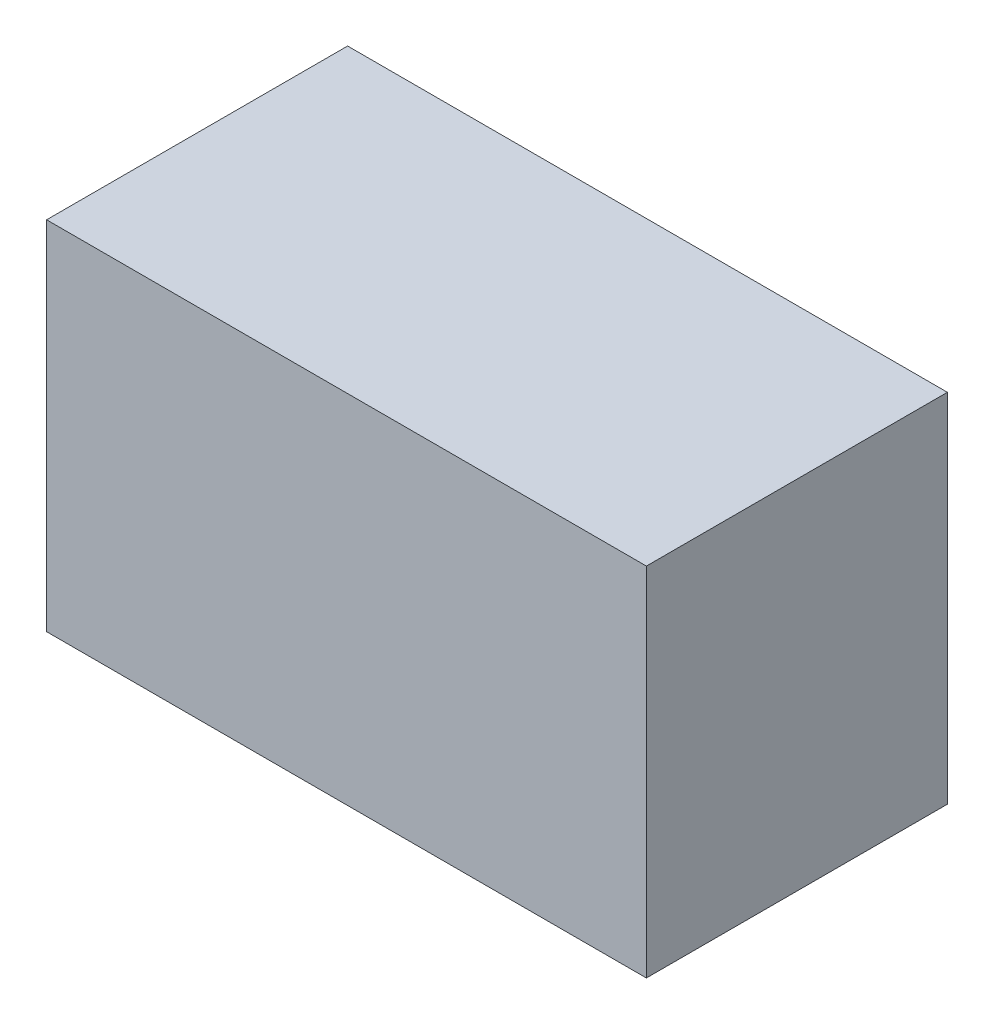
ISO-10303-21;
HEADER;
FILE_DESCRIPTION(('STEP AP214'),'2;1');
FILE_NAME('part.step','',(''),(''),'','','');
FILE_SCHEMA(('AUTOMOTIVE_DESIGN { 1 0 10303 214 1 1 1 1 }'));
ENDSEC;
DATA;
#1=APPLICATION_CONTEXT('core data for automotive mechanical design processes');
#2=APPLICATION_PROTOCOL_DEFINITION('international standard','automotive_design',2000,#1);
#3=PRODUCT_CONTEXT('',#1,'mechanical');
#4=PRODUCT('Part','Part','',(#3));
#5=PRODUCT_RELATED_PRODUCT_CATEGORY('part','',(#4));
#6=PRODUCT_DEFINITION_FORMATION('','',#4);
#7=PRODUCT_DEFINITION_CONTEXT('part definition',#1,'design');
#8=PRODUCT_DEFINITION('design','',#6,#7);
#9=PRODUCT_DEFINITION_SHAPE('','',#8);
#10=(LENGTH_UNIT() NAMED_UNIT(*) SI_UNIT(.MILLI.,.METRE.));
#11=(NAMED_UNIT(*) PLANE_ANGLE_UNIT() SI_UNIT($,.RADIAN.));
#12=(NAMED_UNIT(*) SI_UNIT($,.STERADIAN.) SOLID_ANGLE_UNIT());
#13=UNCERTAINTY_MEASURE_WITH_UNIT(LENGTH_MEASURE(1.E-05),#10,'distance_accuracy_value','');
#14=(GEOMETRIC_REPRESENTATION_CONTEXT(3) GLOBAL_UNCERTAINTY_ASSIGNED_CONTEXT((#13)) GLOBAL_UNIT_ASSIGNED_CONTEXT((#10,
#11,#12)) REPRESENTATION_CONTEXT('',''));
#15=CARTESIAN_POINT('',(0.,0.,0.));
#16=DIRECTION('',(0.,0.,1.));
#17=DIRECTION('',(1.,0.,0.));
#18=AXIS2_PLACEMENT_3D('',#15,#16,#17);
#19=CARTESIAN_POINT('',(-1.3450151410666,0.800001287646836,0.));
#20=DIRECTION('',(-1.,1.74845553146952E-07,0.));
#21=DIRECTION('',(-1.74845553146952E-07,-1.,0.));
#22=AXIS2_PLACEMENT_3D('',#19,#20,#21);
#23=PLANE('',#22);
#24=DIRECTION('',(-1.74845553109409E-07,-0.999999999999985,0.));
#25=VECTOR('',#24,1.);
#26=CARTESIAN_POINT('',(-1.3450151410666,0.800001287646836,0.));
#27=LINE('',#26,#25);
#28=CARTESIAN_POINT('',(-1.3450151410666,0.800001287646836,0.));
#29=VERTEX_POINT('',#28);
#30=CARTESIAN_POINT('',(-1.34501542081921,-0.799997186474258,0.));
#31=VERTEX_POINT('',#30);
#32=EDGE_CURVE('E11',#29,#31,#27,.T.);
#33=ORIENTED_EDGE('',*,*,#32,.T.);
#34=DIRECTION('',(0.,0.,1.));
#35=VECTOR('',#34,1.);
#36=CARTESIAN_POINT('',(-1.34501542081921,-0.799997186474258,0.));
#37=LINE('',#36,#35);
#38=CARTESIAN_POINT('',(-1.34501542081921,-0.799997186474258,1.34999978542328));
#39=VERTEX_POINT('',#38);
#40=EDGE_CURVE('E88',#31,#39,#37,.T.);
#41=ORIENTED_EDGE('',*,*,#40,.T.);
#42=DIRECTION('',(-1.74845553109409E-07,-0.999999999999985,0.));
#43=VECTOR('',#42,1.);
#44=CARTESIAN_POINT('',(-1.3450151410666,0.800001287646836,1.34999978542328));
#45=LINE('',#44,#43);
#46=CARTESIAN_POINT('',(-1.3450151410666,0.800001287646836,1.34999978542328));
#47=VERTEX_POINT('',#46);
#48=EDGE_CURVE('E83',#47,#39,#45,.T.);
#49=ORIENTED_EDGE('',*,*,#48,.F.);
#50=DIRECTION('',(0.,0.,1.));
#51=VECTOR('',#50,1.);
#52=CARTESIAN_POINT('',(-1.3450151410666,0.800001287646834,0.));
#53=LINE('',#52,#51);
#54=EDGE_CURVE('E72',#29,#47,#53,.T.);
#55=ORIENTED_EDGE('',*,*,#54,.F.);
#56=EDGE_LOOP('',(#33,#41,#49,#55));
#57=FACE_BOUND('',#56,.T.);
#58=ADVANCED_FACE('F17',(#57),#23,.T.);
#59=CARTESIAN_POINT('',(-1.34501542081921,-0.799997186474258,0.));
#60=DIRECTION('',(-1.74845553146952E-07,-1.,0.));
#61=DIRECTION('',(1.,-1.74845553146952E-07,0.));
#62=AXIS2_PLACEMENT_3D('',#59,#60,#61);
#63=PLANE('',#62);
#64=DIRECTION('',(0.999999999999985,-1.74845553157912E-07,0.));
#65=VECTOR('',#64,1.);
#66=CARTESIAN_POINT('',(-1.34501542081921,-0.799997186474258,0.));
#67=LINE('',#66,#65);
#68=CARTESIAN_POINT('',(1.34498702058704,-0.799997656809225,0.));
#69=VERTEX_POINT('',#68);
#70=EDGE_CURVE('E24',#31,#69,#67,.T.);
#71=ORIENTED_EDGE('',*,*,#70,.T.);
#72=DIRECTION('',(0.,0.,1.));
#73=VECTOR('',#72,1.);
#74=CARTESIAN_POINT('',(1.34498702058704,-0.799997656809223,0.));
#75=LINE('',#74,#73);
#76=CARTESIAN_POINT('',(1.34498702058704,-0.799997656809225,1.34999978542328));
#77=VERTEX_POINT('',#76);
#78=EDGE_CURVE('E85',#69,#77,#75,.T.);
#79=ORIENTED_EDGE('',*,*,#78,.T.);
#80=DIRECTION('',(0.999999999999985,-1.74845553157912E-07,0.));
#81=VECTOR('',#80,1.);
#82=CARTESIAN_POINT('',(-1.34501542081921,-0.799997186474258,1.34999978542328));
#83=LINE('',#82,#81);
#84=EDGE_CURVE('E66',#39,#77,#83,.T.);
#85=ORIENTED_EDGE('',*,*,#84,.F.);
#86=ORIENTED_EDGE('',*,*,#40,.F.);
#87=EDGE_LOOP('',(#71,#79,#85,#86));
#88=FACE_BOUND('',#87,.T.);
#89=ADVANCED_FACE('F89',(#88),#63,.T.);
#90=CARTESIAN_POINT('',(1.34498702058704,-0.799997656809225,0.));
#91=DIRECTION('',(1.,-1.74845553146952E-07,0.));
#92=DIRECTION('',(1.74845553146952E-07,1.,0.));
#93=AXIS2_PLACEMENT_3D('',#90,#91,#92);
#94=PLANE('',#93);
#95=DIRECTION('',(1.74845553109409E-07,0.999999999999985,0.));
#96=VECTOR('',#95,1.);
#97=CARTESIAN_POINT('',(1.34498702058704,-0.799997656809225,0.));
#98=LINE('',#97,#96);
#99=CARTESIAN_POINT('',(1.34498730033965,0.800000817311869,0.));
#100=VERTEX_POINT('',#99);
#101=EDGE_CURVE('E62',#69,#100,#98,.T.);
#102=ORIENTED_EDGE('',*,*,#101,.T.);
#103=DIRECTION('',(0.,0.,1.));
#104=VECTOR('',#103,1.);
#105=CARTESIAN_POINT('',(1.34498730033966,0.800000817311869,0.));
#106=LINE('',#105,#104);
#107=CARTESIAN_POINT('',(1.34498730033965,0.800000817311869,1.34999978542328));
#108=VERTEX_POINT('',#107);
#109=EDGE_CURVE('E55',#100,#108,#106,.T.);
#110=ORIENTED_EDGE('',*,*,#109,.T.);
#111=DIRECTION('',(1.74845553109409E-07,0.999999999999985,0.));
#112=VECTOR('',#111,1.);
#113=CARTESIAN_POINT('',(1.34498702058704,-0.799997656809225,1.34999978542328));
#114=LINE('',#113,#112);
#115=EDGE_CURVE('E59',#77,#108,#114,.T.);
#116=ORIENTED_EDGE('',*,*,#115,.F.);
#117=ORIENTED_EDGE('',*,*,#78,.F.);
#118=EDGE_LOOP('',(#102,#110,#116,#117));
#119=FACE_BOUND('',#118,.T.);
#120=ADVANCED_FACE('F57',(#119),#94,.T.);
#121=CARTESIAN_POINT('',(1.34498730033965,0.800000817311869,0.));
#122=DIRECTION('',(1.74845553146952E-07,1.,0.));
#123=DIRECTION('',(-1.,1.74845553146952E-07,0.));
#124=AXIS2_PLACEMENT_3D('',#121,#122,#123);
#125=PLANE('',#124);
#126=DIRECTION('',(-0.999999999999985,1.74845553157912E-07,0.));
#127=VECTOR('',#126,1.);
#128=CARTESIAN_POINT('',(1.34498730033965,0.800000817311869,0.));
#129=LINE('',#128,#127);
#130=EDGE_CURVE('E65',#100,#29,#129,.T.);
#131=ORIENTED_EDGE('',*,*,#130,.T.);
#132=ORIENTED_EDGE('',*,*,#54,.T.);
#133=DIRECTION('',(-0.999999999999985,1.74845553157912E-07,0.));
#134=VECTOR('',#133,1.);
#135=CARTESIAN_POINT('',(1.34498730033965,0.800000817311869,1.34999978542328));
#136=LINE('',#135,#134);
#137=EDGE_CURVE('E70',#108,#47,#136,.T.);
#138=ORIENTED_EDGE('',*,*,#137,.F.);
#139=ORIENTED_EDGE('',*,*,#109,.F.);
#140=EDGE_LOOP('',(#131,#132,#138,#139));
#141=FACE_BOUND('',#140,.T.);
#142=ADVANCED_FACE('F71',(#141),#125,.T.);
#143=CARTESIAN_POINT('',(-404.150024414063,-94.1249313354492,1.34999978542328));
#144=DIRECTION('',(0.,0.,1.));
#145=DIRECTION('',(1.,-1.74845553146952E-07,0.));
#146=AXIS2_PLACEMENT_3D('',#143,#144,#145);
#147=PLANE('',#146);
#148=ORIENTED_EDGE('',*,*,#48,.T.);
#149=ORIENTED_EDGE('',*,*,#84,.T.);
#150=ORIENTED_EDGE('',*,*,#115,.T.);
#151=ORIENTED_EDGE('',*,*,#137,.T.);
#152=EDGE_LOOP('',(#148,#149,#150,#151));
#153=FACE_BOUND('',#152,.T.);
#154=ADVANCED_FACE('F76',(#153),#147,.T.);
#155=CARTESIAN_POINT('',(-404.150024414063,-94.1249313354492,0.));
#156=DIRECTION('',(0.,0.,1.));
#157=DIRECTION('',(1.,-1.74845553146952E-07,0.));
#158=AXIS2_PLACEMENT_3D('',#155,#156,#157);
#159=PLANE('',#158);
#160=ORIENTED_EDGE('',*,*,#130,.F.);
#161=ORIENTED_EDGE('',*,*,#101,.F.);
#162=ORIENTED_EDGE('',*,*,#70,.F.);
#163=ORIENTED_EDGE('',*,*,#32,.F.);
#164=EDGE_LOOP('',(#160,#161,#162,#163));
#165=FACE_BOUND('',#164,.T.);
#166=ADVANCED_FACE('F91',(#165),#159,.F.);
#167=CLOSED_SHELL('',(#58,#89,#120,#142,#154,#166));
#168=MANIFOLD_SOLID_BREP('B1',#167);
#169=ADVANCED_BREP_SHAPE_REPRESENTATION('',(#18,#168),#14);
#170=SHAPE_DEFINITION_REPRESENTATION(#9,#169);
ENDSEC;
END-ISO-10303-21;
